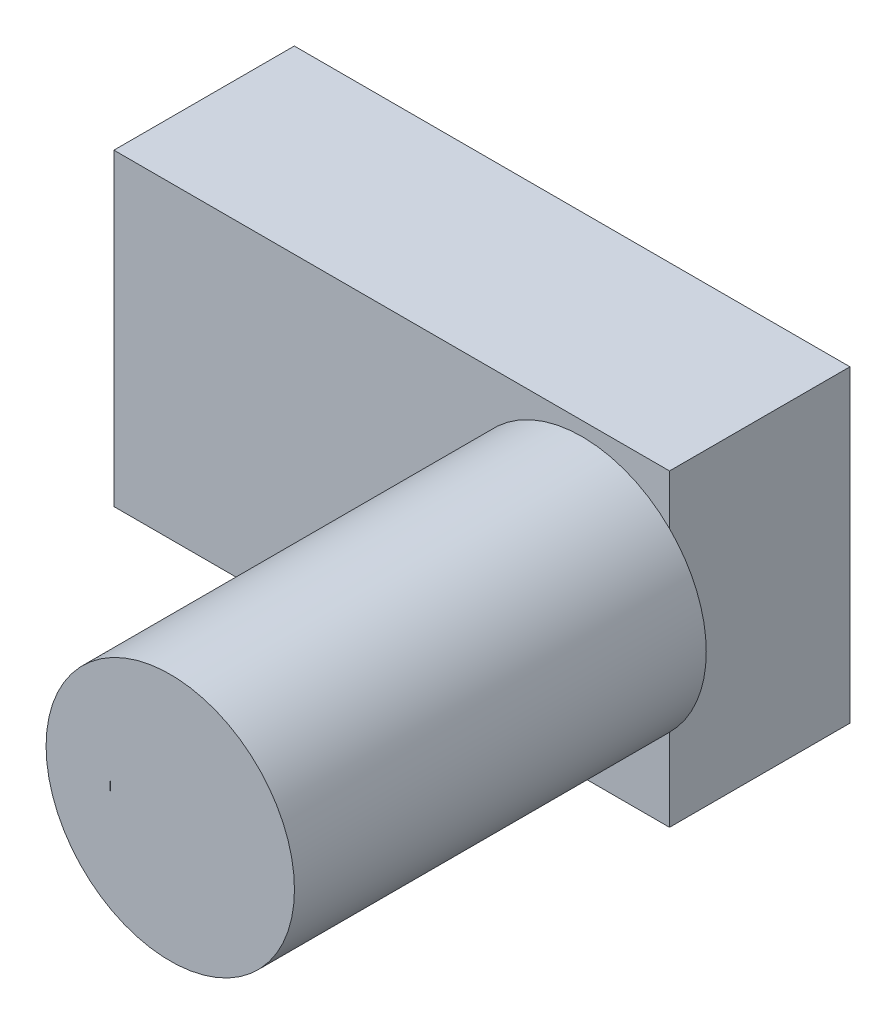
ISO-10303-21;
HEADER;
FILE_DESCRIPTION(('STEP AP214'),'2;1');
FILE_NAME('part.step','',(''),(''),'','','');
FILE_SCHEMA(('AUTOMOTIVE_DESIGN { 1 0 10303 214 1 1 1 1 }'));
ENDSEC;
DATA;
#1=APPLICATION_CONTEXT('core data for automotive mechanical design processes');
#2=APPLICATION_PROTOCOL_DEFINITION('international standard','automotive_design',2000,#1);
#3=PRODUCT_CONTEXT('',#1,'mechanical');
#4=PRODUCT('Part','Part','',(#3));
#5=PRODUCT_RELATED_PRODUCT_CATEGORY('part','',(#4));
#6=PRODUCT_DEFINITION_FORMATION('','',#4);
#7=PRODUCT_DEFINITION_CONTEXT('part definition',#1,'design');
#8=PRODUCT_DEFINITION('design','',#6,#7);
#9=PRODUCT_DEFINITION_SHAPE('','',#8);
#10=(LENGTH_UNIT() NAMED_UNIT(*) SI_UNIT(.MILLI.,.METRE.));
#11=(NAMED_UNIT(*) PLANE_ANGLE_UNIT() SI_UNIT($,.RADIAN.));
#12=(NAMED_UNIT(*) SI_UNIT($,.STERADIAN.) SOLID_ANGLE_UNIT());
#13=UNCERTAINTY_MEASURE_WITH_UNIT(LENGTH_MEASURE(1.E-05),#10,'distance_accuracy_value','');
#14=(GEOMETRIC_REPRESENTATION_CONTEXT(3) GLOBAL_UNCERTAINTY_ASSIGNED_CONTEXT((#13)) GLOBAL_UNIT_ASSIGNED_CONTEXT((#10,
#11,#12)) REPRESENTATION_CONTEXT('',''));
#15=CARTESIAN_POINT('',(0.,0.,0.));
#16=DIRECTION('',(0.,0.,1.));
#17=DIRECTION('',(1.,0.,0.));
#18=AXIS2_PLACEMENT_3D('',#15,#16,#17);
#19=CARTESIAN_POINT('',(-62.5414024105058,-7.55077319146769,0.));
#20=DIRECTION('',(0.,0.,-1.));
#21=DIRECTION('',(1.,0.,0.));
#22=AXIS2_PLACEMENT_3D('',#19,#20,#21);
#23=PLANE('',#22);
#24=CARTESIAN_POINT('',(9.08017470120266,18.5374457641994,0.));
#25=DIRECTION('',(0.,0.,1.));
#26=DIRECTION('',(1.,0.,0.));
#27=AXIS2_PLACEMENT_3D('',#24,#25,#26);
#28=CIRCLE('',#27,19.);
#29=CARTESIAN_POINT('',(22.4585975894942,32.0288430610711,0.));
#30=VERTEX_POINT('',#29);
#31=CARTESIAN_POINT('',(22.4585975894942,5.04604846732777,0.));
#32=VERTEX_POINT('',#31);
#33=EDGE_CURVE('E132',#30,#32,#28,.T.);
#34=ORIENTED_EDGE('',*,*,#33,.F.);
#35=DIRECTION('',(0.,1.,0.));
#36=VECTOR('',#35,1.);
#37=CARTESIAN_POINT('',(22.4585975894942,39.669557012058,0.));
#38=LINE('',#37,#36);
#39=CARTESIAN_POINT('',(22.4585975894942,39.669557012058,0.));
#40=VERTEX_POINT('',#39);
#41=EDGE_CURVE('E166',#30,#40,#38,.T.);
#42=ORIENTED_EDGE('',*,*,#41,.T.);
#43=DIRECTION('',(-1.,0.,0.));
#44=VECTOR('',#43,1.);
#45=CARTESIAN_POINT('',(-62.5414024105058,39.669557012058,0.));
#46=LINE('',#45,#44);
#47=CARTESIAN_POINT('',(-62.5414024105058,39.669557012058,0.));
#48=VERTEX_POINT('',#47);
#49=EDGE_CURVE('E158',#40,#48,#46,.T.);
#50=ORIENTED_EDGE('',*,*,#49,.T.);
#51=DIRECTION('',(0.,-1.,0.));
#52=VECTOR('',#51,1.);
#53=CARTESIAN_POINT('',(-62.5414024105058,39.669557012058,0.));
#54=LINE('',#53,#52);
#55=CARTESIAN_POINT('',(-62.5414024105058,-7.55077319146769,0.));
#56=VERTEX_POINT('',#55);
#57=EDGE_CURVE('E170',#48,#56,#54,.T.);
#58=ORIENTED_EDGE('',*,*,#57,.T.);
#59=DIRECTION('',(1.,0.,0.));
#60=VECTOR('',#59,1.);
#61=CARTESIAN_POINT('',(-62.5414024105058,-7.55077319146769,0.));
#62=LINE('',#61,#60);
#63=CARTESIAN_POINT('',(22.4585975894942,-7.55077319146769,0.));
#64=VERTEX_POINT('',#63);
#65=EDGE_CURVE('E167',#56,#64,#62,.T.);
#66=ORIENTED_EDGE('',*,*,#65,.T.);
#67=EDGE_CURVE('E162',#64,#32,#38,.T.);
#68=ORIENTED_EDGE('',*,*,#67,.T.);
#69=EDGE_LOOP('',(#34,#42,#50,#58,#66,#68));
#70=FACE_BOUND('',#69,.T.);
#71=ADVANCED_FACE('F32',(#70),#23,.F.);
#72=CARTESIAN_POINT('',(-62.5414024105058,39.669557012058,-27.6));
#73=DIRECTION('',(1.,0.,0.));
#74=DIRECTION('',(0.,0.,1.));
#75=AXIS2_PLACEMENT_3D('',#72,#73,#74);
#76=PLANE('',#75);
#77=DIRECTION('',(0.,0.,1.));
#78=VECTOR('',#77,1.);
#79=CARTESIAN_POINT('',(-62.5414024105058,8.5791283346381,-24.));
#80=LINE('',#79,#78);
#81=CARTESIAN_POINT('',(-62.5414024105058,8.5791283346381,-24.));
#82=VERTEX_POINT('',#81);
#83=CARTESIAN_POINT('',(-62.5414024105058,8.5791283346381,-14.38));
#84=VERTEX_POINT('',#83);
#85=EDGE_CURVE('E173',#82,#84,#80,.T.);
#86=ORIENTED_EDGE('',*,*,#85,.T.);
#87=DIRECTION('',(0.,-1.,0.));
#88=VECTOR('',#87,1.);
#89=CARTESIAN_POINT('',(-62.5414024105058,39.669557012058,-14.38));
#90=LINE('',#89,#88);
#91=CARTESIAN_POINT('',(-62.5414024105058,-7.55077319146769,-14.38));
#92=VERTEX_POINT('',#91);
#93=EDGE_CURVE('E113',#84,#92,#90,.T.);
#94=ORIENTED_EDGE('',*,*,#93,.T.);
#95=DIRECTION('',(0.,0.,1.));
#96=VECTOR('',#95,1.);
#97=CARTESIAN_POINT('',(-62.5414024105058,-7.55077319146769,-27.6));
#98=LINE('',#97,#96);
#99=EDGE_CURVE('E122',#92,#56,#98,.T.);
#100=ORIENTED_EDGE('',*,*,#99,.T.);
#101=ORIENTED_EDGE('',*,*,#57,.F.);
#102=DIRECTION('',(0.,0.,1.));
#103=VECTOR('',#102,1.);
#104=CARTESIAN_POINT('',(-62.5414024105058,39.669557012058,-27.6));
#105=LINE('',#104,#103);
#106=CARTESIAN_POINT('',(-62.5414024105058,39.669557012058,-27.6));
#107=VERTEX_POINT('',#106);
#108=EDGE_CURVE('E155',#107,#48,#105,.T.);
#109=ORIENTED_EDGE('',*,*,#108,.F.);
#110=DIRECTION('',(0.,-1.,0.));
#111=VECTOR('',#110,1.);
#112=CARTESIAN_POINT('',(-62.5414024105058,39.669557012058,-27.6));
#113=LINE('',#112,#111);
#114=CARTESIAN_POINT('',(-62.5414024105058,-7.55077319146769,-27.6));
#115=VERTEX_POINT('',#114);
#116=EDGE_CURVE('E161',#107,#115,#113,.T.);
#117=ORIENTED_EDGE('',*,*,#116,.T.);
#118=CARTESIAN_POINT('',(-62.5414024105058,-7.55077319146769,-24.));
#119=VERTEX_POINT('',#118);
#120=EDGE_CURVE('E148',#115,#119,#98,.T.);
#121=ORIENTED_EDGE('',*,*,#120,.T.);
#122=DIRECTION('',(0.,-1.,0.));
#123=VECTOR('',#122,1.);
#124=CARTESIAN_POINT('',(-62.5414024105058,39.669557012058,-24.));
#125=LINE('',#124,#123);
#126=EDGE_CURVE('E184',#82,#119,#125,.T.);
#127=ORIENTED_EDGE('',*,*,#126,.F.);
#128=EDGE_LOOP('',(#86,#94,#100,#101,#109,#117,#121,#127));
#129=FACE_BOUND('',#128,.T.);
#130=ADVANCED_FACE('F188',(#129),#76,.F.);
#131=CARTESIAN_POINT('',(-62.5414024105058,-7.55077319146769,-27.6));
#132=DIRECTION('',(0.,1.,0.));
#133=DIRECTION('',(0.,0.,-1.));
#134=AXIS2_PLACEMENT_3D('',#131,#132,#133);
#135=PLANE('',#134);
#136=ORIENTED_EDGE('',*,*,#120,.F.);
#137=DIRECTION('',(1.,0.,0.));
#138=VECTOR('',#137,1.);
#139=CARTESIAN_POINT('',(-62.5414024105058,-7.55077319146769,-27.6));
#140=LINE('',#139,#138);
#141=CARTESIAN_POINT('',(22.4585975894942,-7.55077319146769,-27.6));
#142=VERTEX_POINT('',#141);
#143=EDGE_CURVE('E178',#115,#142,#140,.T.);
#144=ORIENTED_EDGE('',*,*,#143,.T.);
#145=DIRECTION('',(0.,0.,1.));
#146=VECTOR('',#145,1.);
#147=CARTESIAN_POINT('',(22.4585975894942,-7.55077319146769,-27.6));
#148=LINE('',#147,#146);
#149=EDGE_CURVE('E151',#142,#64,#148,.T.);
#150=ORIENTED_EDGE('',*,*,#149,.T.);
#151=ORIENTED_EDGE('',*,*,#65,.F.);
#152=ORIENTED_EDGE('',*,*,#99,.F.);
#153=DIRECTION('',(1.,0.,0.));
#154=VECTOR('',#153,1.);
#155=CARTESIAN_POINT('',(-62.5414024105058,-7.55077319146769,-14.38));
#156=LINE('',#155,#154);
#157=CARTESIAN_POINT('',(-27.0512584060541,-7.55077319146769,-14.38));
#158=VERTEX_POINT('',#157);
#159=EDGE_CURVE('E110',#92,#158,#156,.T.);
#160=ORIENTED_EDGE('',*,*,#159,.T.);
#161=DIRECTION('',(0.,0.,1.));
#162=VECTOR('',#161,1.);
#163=CARTESIAN_POINT('',(-27.0512584060541,-7.55077319146769,-24.));
#164=LINE('',#163,#162);
#165=CARTESIAN_POINT('',(-27.0512584060541,-7.55077319146769,-24.));
#166=VERTEX_POINT('',#165);
#167=EDGE_CURVE('E40',#158,#166,#164,.F.);
#168=ORIENTED_EDGE('',*,*,#167,.T.);
#169=DIRECTION('',(1.,0.,0.));
#170=VECTOR('',#169,1.);
#171=CARTESIAN_POINT('',(-62.5414024105058,-7.55077319146769,-24.));
#172=LINE('',#171,#170);
#173=EDGE_CURVE('E11',#119,#166,#172,.T.);
#174=ORIENTED_EDGE('',*,*,#173,.F.);
#175=EDGE_LOOP('',(#136,#144,#150,#151,#152,#160,#168,#174));
#176=FACE_BOUND('',#175,.T.);
#177=ADVANCED_FACE('F120',(#176),#135,.F.);
#178=CARTESIAN_POINT('',(22.4585975894942,39.669557012058,-27.6));
#179=DIRECTION('',(-1.,0.,0.));
#180=DIRECTION('',(0.,-1.,0.));
#181=AXIS2_PLACEMENT_3D('',#178,#179,#180);
#182=PLANE('',#181);
#183=ORIENTED_EDGE('',*,*,#67,.F.);
#184=ORIENTED_EDGE('',*,*,#149,.F.);
#185=DIRECTION('',(0.,1.,0.));
#186=VECTOR('',#185,1.);
#187=CARTESIAN_POINT('',(22.4585975894942,39.669557012058,-27.6));
#188=LINE('',#187,#186);
#189=CARTESIAN_POINT('',(22.4585975894942,39.669557012058,-27.6));
#190=VERTEX_POINT('',#189);
#191=EDGE_CURVE('E175',#142,#190,#188,.T.);
#192=ORIENTED_EDGE('',*,*,#191,.T.);
#193=DIRECTION('',(0.,0.,1.));
#194=VECTOR('',#193,1.);
#195=CARTESIAN_POINT('',(22.4585975894942,39.669557012058,-27.6));
#196=LINE('',#195,#194);
#197=EDGE_CURVE('E153',#190,#40,#196,.T.);
#198=ORIENTED_EDGE('',*,*,#197,.T.);
#199=ORIENTED_EDGE('',*,*,#41,.F.);
#200=EDGE_CURVE('E165',#32,#30,#38,.T.);
#201=ORIENTED_EDGE('',*,*,#200,.F.);
#202=EDGE_LOOP('',(#183,#184,#192,#198,#199,#201));
#203=FACE_BOUND('',#202,.T.);
#204=ADVANCED_FACE('F199',(#203),#182,.F.);
#205=CARTESIAN_POINT('',(-62.5414024105058,39.669557012058,-27.6));
#206=DIRECTION('',(0.,-1.,0.));
#207=DIRECTION('',(0.,0.,1.));
#208=AXIS2_PLACEMENT_3D('',#205,#206,#207);
#209=PLANE('',#208);
#210=ORIENTED_EDGE('',*,*,#49,.F.);
#211=ORIENTED_EDGE('',*,*,#197,.F.);
#212=DIRECTION('',(-1.,0.,0.));
#213=VECTOR('',#212,1.);
#214=CARTESIAN_POINT('',(-62.5414024105058,39.669557012058,-27.6));
#215=LINE('',#214,#213);
#216=EDGE_CURVE('E157',#190,#107,#215,.T.);
#217=ORIENTED_EDGE('',*,*,#216,.T.);
#218=ORIENTED_EDGE('',*,*,#108,.T.);
#219=EDGE_LOOP('',(#210,#211,#217,#218));
#220=FACE_BOUND('',#219,.T.);
#221=ADVANCED_FACE('F207',(#220),#209,.F.);
#222=CARTESIAN_POINT('',(-62.5414024105058,-7.55077319146769,-27.6));
#223=DIRECTION('',(0.,0.,-1.));
#224=DIRECTION('',(1.,0.,0.));
#225=AXIS2_PLACEMENT_3D('',#222,#223,#224);
#226=PLANE('',#225);
#227=ORIENTED_EDGE('',*,*,#116,.F.);
#228=ORIENTED_EDGE('',*,*,#216,.F.);
#229=ORIENTED_EDGE('',*,*,#191,.F.);
#230=ORIENTED_EDGE('',*,*,#143,.F.);
#231=EDGE_LOOP('',(#227,#228,#229,#230));
#232=FACE_BOUND('',#231,.T.);
#233=ADVANCED_FACE('F194',(#232),#226,.T.);
#234=CARTESIAN_POINT('',(-21.1862419644348,17.1813946890512,63.));
#235=DIRECTION('',(0.,0.,-1.));
#236=DIRECTION('',(1.,0.,0.));
#237=AXIS2_PLACEMENT_3D('',#234,#235,#236);
#238=CYLINDRICAL_SURFACE('',#237,21.15);
#239=CARTESIAN_POINT('',(-21.1862419644348,17.1813946890512,0.));
#240=DIRECTION('',(0.,0.,1.));
#241=DIRECTION('',(1.,0.,0.));
#242=AXIS2_PLACEMENT_3D('',#239,#240,#241);
#243=CIRCLE('',#242,21.15);
#244=CARTESIAN_POINT('',(-0.140259901825004,19.2764219013581,0.));
#245=VERTEX_POINT('',#244);
#246=CARTESIAN_POINT('',(-0.0372309394255036,16.9768643391397,0.));
#247=VERTEX_POINT('',#246);
#248=EDGE_CURVE('E139',#245,#247,#243,.F.);
#249=ORIENTED_EDGE('',*,*,#248,.T.);
#250=DIRECTION('',(0.,0.,-1.));
#251=VECTOR('',#250,1.);
#252=CARTESIAN_POINT('',(-0.0372309394255019,16.9768643391397,63.));
#253=LINE('',#252,#251);
#254=CARTESIAN_POINT('',(-0.0372309394255019,16.9768643391397,63.));
#255=VERTEX_POINT('',#254);
#256=EDGE_CURVE('E123',#255,#247,#253,.T.);
#257=ORIENTED_EDGE('',*,*,#256,.F.);
#258=CARTESIAN_POINT('',(-21.1862419644348,17.1813946890512,63.));
#259=DIRECTION('',(0.,0.,1.));
#260=DIRECTION('',(1.,0.,0.));
#261=AXIS2_PLACEMENT_3D('',#258,#259,#260);
#262=CIRCLE('',#261,21.15);
#263=CARTESIAN_POINT('',(-0.140259901825004,19.2764219013581,63.));
#264=VERTEX_POINT('',#263);
#265=EDGE_CURVE('E142',#255,#264,#262,.T.);
#266=ORIENTED_EDGE('',*,*,#265,.T.);
#267=DIRECTION('',(0.,0.,-1.));
#268=VECTOR('',#267,1.);
#269=CARTESIAN_POINT('',(-0.140259901825004,19.2764219013581,63.));
#270=LINE('',#269,#268);
#271=EDGE_CURVE('E126',#264,#245,#270,.T.);
#272=ORIENTED_EDGE('',*,*,#271,.T.);
#273=EDGE_LOOP('',(#249,#257,#266,#272));
#274=FACE_BOUND('',#273,.T.);
#275=ADVANCED_FACE('F214',(#274),#238,.F.);
#276=CARTESIAN_POINT('',(-19.9295775037876,-71.9989985881213,0.));
#277=DIRECTION('',(0.,0.,-1.));
#278=DIRECTION('',(1.,0.,0.));
#279=AXIS2_PLACEMENT_3D('',#276,#277,#278);
#280=PLANE('',#279);
#281=EDGE_CURVE('E136',#32,#30,#28,.T.);
#282=ORIENTED_EDGE('',*,*,#281,.F.);
#283=ORIENTED_EDGE('',*,*,#200,.T.);
#284=EDGE_LOOP('',(#282,#283));
#285=FACE_BOUND('',#284,.T.);
#286=ADVANCED_FACE('F212',(#285),#280,.T.);
#287=CARTESIAN_POINT('',(9.08017470120266,18.5374457641994,63.));
#288=DIRECTION('',(0.,0.,-1.));
#289=DIRECTION('',(1.,0.,0.));
#290=AXIS2_PLACEMENT_3D('',#287,#288,#289);
#291=CYLINDRICAL_SURFACE('',#290,9.24999999999999);
#292=CARTESIAN_POINT('',(9.08017470120266,18.5374457641994,0.));
#293=DIRECTION('',(0.,0.,1.));
#294=DIRECTION('',(1.,0.,0.));
#295=AXIS2_PLACEMENT_3D('',#292,#293,#294);
#296=CIRCLE('',#295,9.24999999999999);
#297=EDGE_CURVE('E137',#245,#247,#296,.T.);
#298=ORIENTED_EDGE('',*,*,#297,.F.);
#299=ORIENTED_EDGE('',*,*,#271,.F.);
#300=CARTESIAN_POINT('',(9.08017470120266,18.5374457641994,63.));
#301=DIRECTION('',(0.,0.,1.));
#302=DIRECTION('',(1.,0.,0.));
#303=AXIS2_PLACEMENT_3D('',#300,#301,#302);
#304=CIRCLE('',#303,9.24999999999999);
#305=EDGE_CURVE('E135',#264,#255,#304,.T.);
#306=ORIENTED_EDGE('',*,*,#305,.T.);
#307=ORIENTED_EDGE('',*,*,#256,.T.);
#308=EDGE_LOOP('',(#298,#299,#306,#307));
#309=FACE_BOUND('',#308,.T.);
#310=ADVANCED_FACE('F34',(#309),#291,.F.);
#311=CARTESIAN_POINT('',(9.08017470120266,18.5374457641994,63.));
#312=DIRECTION('',(0.,0.,-1.));
#313=DIRECTION('',(1.,0.,0.));
#314=AXIS2_PLACEMENT_3D('',#311,#312,#313);
#315=CYLINDRICAL_SURFACE('',#314,19.);
#316=CARTESIAN_POINT('',(9.08017470120266,18.5374457641994,63.));
#317=DIRECTION('',(0.,0.,1.));
#318=DIRECTION('',(1.,0.,0.));
#319=AXIS2_PLACEMENT_3D('',#316,#317,#318);
#320=CIRCLE('',#319,19.);
#321=CARTESIAN_POINT('',(28.0801747012027,18.5374457641994,63.));
#322=VERTEX_POINT('',#321);
#323=EDGE_CURVE('E130',#322,#322,#320,.T.);
#324=ORIENTED_EDGE('',*,*,#323,.F.);
#325=EDGE_LOOP('',(#324));
#326=FACE_BOUND('',#325,.T.);
#327=ORIENTED_EDGE('',*,*,#33,.T.);
#328=ORIENTED_EDGE('',*,*,#281,.T.);
#329=EDGE_LOOP('',(#327,#328));
#330=FACE_BOUND('',#329,.T.);
#331=ADVANCED_FACE('F210',(#326,#330),#315,.T.);
#332=CARTESIAN_POINT('',(-19.9295775037876,-71.9989985881213,63.));
#333=DIRECTION('',(0.,0.,-1.));
#334=DIRECTION('',(1.,0.,0.));
#335=AXIS2_PLACEMENT_3D('',#332,#333,#334);
#336=PLANE('',#335);
#337=ORIENTED_EDGE('',*,*,#305,.F.);
#338=ORIENTED_EDGE('',*,*,#265,.F.);
#339=EDGE_LOOP('',(#337,#338));
#340=FACE_BOUND('',#339,.T.);
#341=ORIENTED_EDGE('',*,*,#323,.T.);
#342=EDGE_LOOP('',(#341));
#343=FACE_BOUND('',#342,.T.);
#344=ADVANCED_FACE('F234',(#340,#343),#336,.F.);
#345=ORIENTED_EDGE('',*,*,#248,.F.);
#346=ORIENTED_EDGE('',*,*,#297,.T.);
#347=EDGE_LOOP('',(#345,#346));
#348=FACE_BOUND('',#347,.T.);
#349=ADVANCED_FACE('F226',(#348),#23,.F.);
#350=CARTESIAN_POINT('',(-45.0300187696335,0.,-24.));
#351=DIRECTION('',(0.,0.,1.));
#352=DIRECTION('',(-1.,0.,0.));
#353=AXIS2_PLACEMENT_3D('',#350,#351,#352);
#354=CYLINDRICAL_SURFACE('',#353,19.5);
#355=CARTESIAN_POINT('',(-45.0300187696335,0.,-24.));
#356=DIRECTION('',(0.,0.,1.));
#357=DIRECTION('',(1.,0.,0.));
#358=AXIS2_PLACEMENT_3D('',#355,#356,#357);
#359=CIRCLE('',#358,19.5);
#360=EDGE_CURVE('E46',#82,#166,#359,.T.);
#361=ORIENTED_EDGE('',*,*,#360,.T.);
#362=ORIENTED_EDGE('',*,*,#167,.F.);
#363=CARTESIAN_POINT('',(-45.0300187696335,0.,-14.38));
#364=DIRECTION('',(0.,0.,1.));
#365=DIRECTION('',(1.,0.,0.));
#366=AXIS2_PLACEMENT_3D('',#363,#364,#365);
#367=CIRCLE('',#366,19.5);
#368=EDGE_CURVE('E54',#84,#158,#367,.T.);
#369=ORIENTED_EDGE('',*,*,#368,.F.);
#370=ORIENTED_EDGE('',*,*,#85,.F.);
#371=EDGE_LOOP('',(#361,#362,#369,#370));
#372=FACE_BOUND('',#371,.T.);
#373=ADVANCED_FACE('F117',(#372),#354,.T.);
#374=CARTESIAN_POINT('',(-32.0387692987252,-58.7947184610287,-24.));
#375=DIRECTION('',(0.,0.,-1.));
#376=DIRECTION('',(1.,0.,0.));
#377=AXIS2_PLACEMENT_3D('',#374,#375,#376);
#378=PLANE('',#377);
#379=ORIENTED_EDGE('',*,*,#126,.T.);
#380=ORIENTED_EDGE('',*,*,#173,.T.);
#381=ORIENTED_EDGE('',*,*,#360,.F.);
#382=EDGE_LOOP('',(#379,#380,#381));
#383=FACE_BOUND('',#382,.T.);
#384=ADVANCED_FACE('F190',(#383),#378,.T.);
#385=CARTESIAN_POINT('',(-32.0387692987252,-58.7947184610287,-14.38));
#386=DIRECTION('',(0.,0.,-1.));
#387=DIRECTION('',(1.,0.,0.));
#388=AXIS2_PLACEMENT_3D('',#385,#386,#387);
#389=PLANE('',#388);
#390=ORIENTED_EDGE('',*,*,#368,.T.);
#391=ORIENTED_EDGE('',*,*,#159,.F.);
#392=ORIENTED_EDGE('',*,*,#93,.F.);
#393=EDGE_LOOP('',(#390,#391,#392));
#394=FACE_BOUND('',#393,.T.);
#395=ADVANCED_FACE('F108',(#394),#389,.F.);
#396=CLOSED_SHELL('',(#71,#130,#177,#204,#221,#233,#275,#286,#310,#331,#344,#349,#373,#384,#395));
#397=MANIFOLD_SOLID_BREP('B2',#396);
#398=ADVANCED_BREP_SHAPE_REPRESENTATION('',(#18,#397),#14);
#399=SHAPE_DEFINITION_REPRESENTATION(#9,#398);
ENDSEC;
END-ISO-10303-21;
